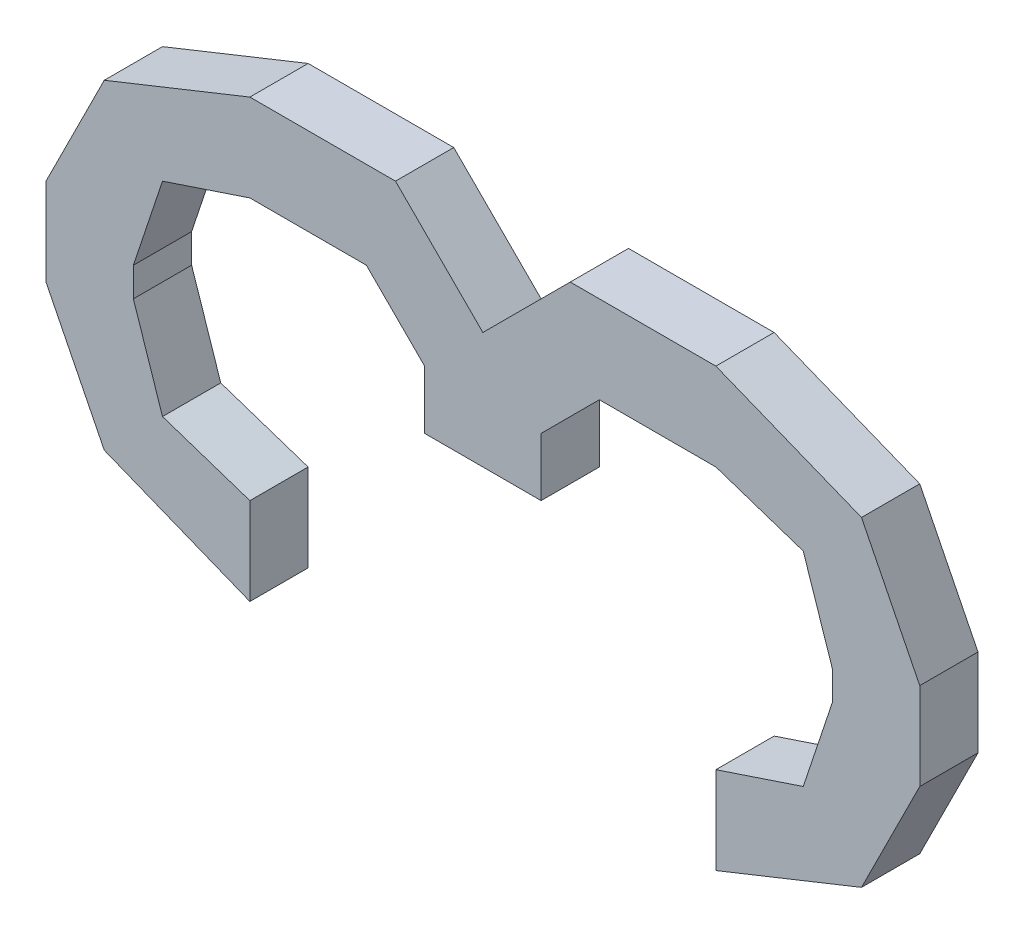
ISO-10303-21;
HEADER;
FILE_DESCRIPTION(('STEP AP214'),'2;1');
FILE_NAME('part.step','',(''),(''),'','','');
FILE_SCHEMA(('AUTOMOTIVE_DESIGN { 1 0 10303 214 1 1 1 1 }'));
ENDSEC;
DATA;
#1=APPLICATION_CONTEXT('core data for automotive mechanical design processes');
#2=APPLICATION_PROTOCOL_DEFINITION('international standard','automotive_design',2000,#1);
#3=PRODUCT_CONTEXT('',#1,'mechanical');
#4=PRODUCT('Part','Part','',(#3));
#5=PRODUCT_RELATED_PRODUCT_CATEGORY('part','',(#4));
#6=PRODUCT_DEFINITION_FORMATION('','',#4);
#7=PRODUCT_DEFINITION_CONTEXT('part definition',#1,'design');
#8=PRODUCT_DEFINITION('design','',#6,#7);
#9=PRODUCT_DEFINITION_SHAPE('','',#8);
#10=(LENGTH_UNIT() NAMED_UNIT(*) SI_UNIT(.MILLI.,.METRE.));
#11=(NAMED_UNIT(*) PLANE_ANGLE_UNIT() SI_UNIT($,.RADIAN.));
#12=(NAMED_UNIT(*) SI_UNIT($,.STERADIAN.) SOLID_ANGLE_UNIT());
#13=UNCERTAINTY_MEASURE_WITH_UNIT(LENGTH_MEASURE(1.E-05),#10,'distance_accuracy_value','');
#14=(GEOMETRIC_REPRESENTATION_CONTEXT(3) GLOBAL_UNCERTAINTY_ASSIGNED_CONTEXT((#13)) GLOBAL_UNIT_ASSIGNED_CONTEXT((#10,
#11,#12)) REPRESENTATION_CONTEXT('',''));
#15=CARTESIAN_POINT('',(0.,0.,0.));
#16=DIRECTION('',(0.,0.,1.));
#17=DIRECTION('',(1.,0.,0.));
#18=AXIS2_PLACEMENT_3D('',#15,#16,#17);
#19=CARTESIAN_POINT('',(-0.1016,-0.09524999999999,0.));
#20=DIRECTION('',(0.,0.,1.));
#21=DIRECTION('',(1.,0.,0.));
#22=AXIS2_PLACEMENT_3D('',#19,#20,#21);
#23=PLANE('',#22);
#24=DIRECTION('',(0.447213595499958,-0.894427190999916,0.));
#25=VECTOR('',#24,1.);
#26=CARTESIAN_POINT('',(-0.1651,-0.06985,0.));
#27=LINE('',#26,#25);
#28=CARTESIAN_POINT('',(-0.190500000000001,-0.0190499999999905,0.));
#29=VERTEX_POINT('',#28);
#30=CARTESIAN_POINT('',(-0.165099999999999,-0.0698499999999978,0.));
#31=VERTEX_POINT('',#30);
#32=EDGE_CURVE('E398',#29,#31,#27,.T.);
#33=ORIENTED_EDGE('',*,*,#32,.F.);
#34=DIRECTION('',(0.,1.,0.));
#35=VECTOR('',#34,1.);
#36=CARTESIAN_POINT('',(-0.1905,-0.01904999999999,0.));
#37=LINE('',#36,#35);
#38=CARTESIAN_POINT('',(-0.1905,0.01905000000002,0.));
#39=VERTEX_POINT('',#38);
#40=EDGE_CURVE('E393',#39,#29,#37,.F.);
#41=ORIENTED_EDGE('',*,*,#40,.F.);
#42=DIRECTION('',(-0.447213595499958,-0.894427190999916,0.));
#43=VECTOR('',#42,1.);
#44=CARTESIAN_POINT('',(-0.1905,0.01905000000002,0.));
#45=LINE('',#44,#43);
#46=CARTESIAN_POINT('',(-0.165100000000002,0.069850000000001,0.));
#47=VERTEX_POINT('',#46);
#48=EDGE_CURVE('E388',#47,#39,#45,.T.);
#49=ORIENTED_EDGE('',*,*,#48,.F.);
#50=DIRECTION('',(-0.928476690885259,-0.371390676354104,0.));
#51=VECTOR('',#50,1.);
#52=CARTESIAN_POINT('',(-0.1651,0.06985,0.));
#53=LINE('',#52,#51);
#54=CARTESIAN_POINT('',(-0.101599999999998,0.0952500000000157,0.));
#55=VERTEX_POINT('',#54);
#56=EDGE_CURVE('E383',#55,#47,#53,.T.);
#57=ORIENTED_EDGE('',*,*,#56,.F.);
#58=DIRECTION('',(1.,0.,0.));
#59=VECTOR('',#58,1.);
#60=CARTESIAN_POINT('',(-0.1016,0.09525000000002,0.));
#61=LINE('',#60,#59);
#62=CARTESIAN_POINT('',(-0.0381,0.09525000000002,0.));
#63=VERTEX_POINT('',#62);
#64=EDGE_CURVE('E378',#63,#55,#61,.F.);
#65=ORIENTED_EDGE('',*,*,#64,.F.);
#66=DIRECTION('',(-0.707106781186048,0.707106781187048,0.));
#67=VECTOR('',#66,1.);
#68=CARTESIAN_POINT('',(-0.0381,0.09525000000002,0.));
#69=LINE('',#68,#67);
#70=CARTESIAN_POINT('',(0.,0.0571500000000045,0.));
#71=VERTEX_POINT('',#70);
#72=EDGE_CURVE('E373',#71,#63,#69,.T.);
#73=ORIENTED_EDGE('',*,*,#72,.F.);
#74=DIRECTION('',(-0.707106781186048,-0.707106781187048,0.));
#75=VECTOR('',#74,1.);
#76=CARTESIAN_POINT('',(0.,0.05715000000001,0.));
#77=LINE('',#76,#75);
#78=CARTESIAN_POINT('',(0.0380999999999945,0.0952500000000255,0.));
#79=VERTEX_POINT('',#78);
#80=EDGE_CURVE('E368',#79,#71,#77,.T.);
#81=ORIENTED_EDGE('',*,*,#80,.F.);
#82=DIRECTION('',(1.,0.,0.));
#83=VECTOR('',#82,1.);
#84=CARTESIAN_POINT('',(0.0381,0.09525000000002,0.));
#85=LINE('',#84,#83);
#86=CARTESIAN_POINT('',(0.1016,0.09525000000002,0.));
#87=VERTEX_POINT('',#86);
#88=EDGE_CURVE('E363',#87,#79,#85,.F.);
#89=ORIENTED_EDGE('',*,*,#88,.F.);
#90=DIRECTION('',(-0.928476690885259,0.371390676354104,0.));
#91=VECTOR('',#90,1.);
#92=CARTESIAN_POINT('',(0.1016,0.09525000000002,0.));
#93=LINE('',#92,#91);
#94=CARTESIAN_POINT('',(0.165100000000002,0.0698500000000043,0.));
#95=VERTEX_POINT('',#94);
#96=EDGE_CURVE('E358',#95,#87,#93,.T.);
#97=ORIENTED_EDGE('',*,*,#96,.F.);
#98=DIRECTION('',(-0.447213595499958,0.894427190999916,0.));
#99=VECTOR('',#98,1.);
#100=CARTESIAN_POINT('',(0.1651,0.06985,0.));
#101=LINE('',#100,#99);
#102=CARTESIAN_POINT('',(0.190499999999998,0.019050000000019,0.));
#103=VERTEX_POINT('',#102);
#104=EDGE_CURVE('E353',#103,#95,#101,.T.);
#105=ORIENTED_EDGE('',*,*,#104,.F.);
#106=DIRECTION('',(0.,1.,0.));
#107=VECTOR('',#106,1.);
#108=CARTESIAN_POINT('',(0.1905,0.01905000000002,0.));
#109=LINE('',#108,#107);
#110=CARTESIAN_POINT('',(0.1905,-0.01904999999999,0.));
#111=VERTEX_POINT('',#110);
#112=EDGE_CURVE('E348',#111,#103,#109,.T.);
#113=ORIENTED_EDGE('',*,*,#112,.F.);
#114=DIRECTION('',(0.447213595499958,0.894427190999916,0.));
#115=VECTOR('',#114,1.);
#116=CARTESIAN_POINT('',(0.1905,-0.01904999999999,0.));
#117=LINE('',#116,#115);
#118=CARTESIAN_POINT('',(0.165099999999999,-0.0698499999999995,0.));
#119=VERTEX_POINT('',#118);
#120=EDGE_CURVE('E343',#119,#111,#117,.T.);
#121=ORIENTED_EDGE('',*,*,#120,.F.);
#122=DIRECTION('',(0.928476690885259,0.371390676354104,0.));
#123=VECTOR('',#122,1.);
#124=CARTESIAN_POINT('',(0.1651,-0.06985,0.));
#125=LINE('',#124,#123);
#126=CARTESIAN_POINT('',(0.101600000000001,-0.0952499999999921,0.));
#127=VERTEX_POINT('',#126);
#128=EDGE_CURVE('E338',#127,#119,#125,.T.);
#129=ORIENTED_EDGE('',*,*,#128,.F.);
#130=DIRECTION('',(0.,1.,0.));
#131=VECTOR('',#130,1.);
#132=CARTESIAN_POINT('',(0.1016,-0.09524999999999,0.));
#133=LINE('',#132,#131);
#134=CARTESIAN_POINT('',(0.1016,-0.05714999999998,0.));
#135=VERTEX_POINT('',#134);
#136=EDGE_CURVE('E333',#135,#127,#133,.F.);
#137=ORIENTED_EDGE('',*,*,#136,.F.);
#138=DIRECTION('',(-0.948683298050514,-0.316227766016838,0.));
#139=VECTOR('',#138,1.);
#140=CARTESIAN_POINT('',(0.1016,-0.05714999999998,0.));
#141=LINE('',#140,#139);
#142=CARTESIAN_POINT('',(0.1397,-0.04444999999998,0.));
#143=VERTEX_POINT('',#142);
#144=EDGE_CURVE('E328',#143,#135,#141,.T.);
#145=ORIENTED_EDGE('',*,*,#144,.F.);
#146=DIRECTION('',(-0.316227766016838,-0.948683298050514,0.));
#147=VECTOR('',#146,1.);
#148=CARTESIAN_POINT('',(0.1397,-0.04444999999998,0.));
#149=LINE('',#148,#147);
#150=CARTESIAN_POINT('',(0.152399999999999,-0.00634999999999755,0.));
#151=VERTEX_POINT('',#150);
#152=EDGE_CURVE('E323',#151,#143,#149,.T.);
#153=ORIENTED_EDGE('',*,*,#152,.F.);
#154=DIRECTION('',(0.,1.,0.));
#155=VECTOR('',#154,1.);
#156=CARTESIAN_POINT('',(0.1524,-0.006349999999998,0.));
#157=LINE('',#156,#155);
#158=CARTESIAN_POINT('',(0.1524,0.00634999999999803,0.));
#159=VERTEX_POINT('',#158);
#160=EDGE_CURVE('E318',#159,#151,#157,.F.);
#161=ORIENTED_EDGE('',*,*,#160,.F.);
#162=DIRECTION('',(0.316227766016838,-0.948683298050514,0.));
#163=VECTOR('',#162,1.);
#164=CARTESIAN_POINT('',(0.1524,0.006349999999998,0.));
#165=LINE('',#164,#163);
#166=CARTESIAN_POINT('',(0.139699999999999,0.0444500000000097,0.));
#167=VERTEX_POINT('',#166);
#168=EDGE_CURVE('E313',#167,#159,#165,.T.);
#169=ORIENTED_EDGE('',*,*,#168,.F.);
#170=DIRECTION('',(0.948683298050514,-0.316227766016838,0.));
#171=VECTOR('',#170,1.);
#172=CARTESIAN_POINT('',(0.1397,0.04445000000001,0.));
#173=LINE('',#172,#171);
#174=CARTESIAN_POINT('',(0.1016,0.05715000000001,0.));
#175=VERTEX_POINT('',#174);
#176=EDGE_CURVE('E308',#175,#167,#173,.T.);
#177=ORIENTED_EDGE('',*,*,#176,.F.);
#178=DIRECTION('',(1.,0.,0.));
#179=VECTOR('',#178,1.);
#180=CARTESIAN_POINT('',(0.1016,0.05715000000001,0.));
#181=LINE('',#180,#179);
#182=CARTESIAN_POINT('',(0.0508,0.05715000000001,0.));
#183=VERTEX_POINT('',#182);
#184=EDGE_CURVE('E303',#183,#175,#181,.T.);
#185=ORIENTED_EDGE('',*,*,#184,.F.);
#186=DIRECTION('',(0.707106781186548,0.707106781186548,0.));
#187=VECTOR('',#186,1.);
#188=CARTESIAN_POINT('',(0.0508,0.05715000000001,0.));
#189=LINE('',#188,#187);
#190=CARTESIAN_POINT('',(0.0254000000000013,0.0317500000000188,0.));
#191=VERTEX_POINT('',#190);
#192=EDGE_CURVE('E298',#191,#183,#189,.T.);
#193=ORIENTED_EDGE('',*,*,#192,.F.);
#194=DIRECTION('',(0.,1.,0.));
#195=VECTOR('',#194,1.);
#196=CARTESIAN_POINT('',(0.0254,0.03175000000002,0.));
#197=LINE('',#196,#195);
#198=CARTESIAN_POINT('',(0.0254,0.006349999999998,0.));
#199=VERTEX_POINT('',#198);
#200=EDGE_CURVE('E293',#199,#191,#197,.T.);
#201=ORIENTED_EDGE('',*,*,#200,.F.);
#202=DIRECTION('',(1.,0.,0.));
#203=VECTOR('',#202,1.);
#204=CARTESIAN_POINT('',(0.0254,0.006349999999998,0.));
#205=LINE('',#204,#203);
#206=CARTESIAN_POINT('',(-0.0254,0.006349999999998,0.));
#207=VERTEX_POINT('',#206);
#208=EDGE_CURVE('E288',#207,#199,#205,.T.);
#209=ORIENTED_EDGE('',*,*,#208,.F.);
#210=DIRECTION('',(0.,1.,0.));
#211=VECTOR('',#210,1.);
#212=CARTESIAN_POINT('',(-0.0254,0.006349999999998,0.));
#213=LINE('',#212,#211);
#214=CARTESIAN_POINT('',(-0.0254,0.03175000000002,0.));
#215=VERTEX_POINT('',#214);
#216=EDGE_CURVE('E283',#215,#207,#213,.F.);
#217=ORIENTED_EDGE('',*,*,#216,.F.);
#218=DIRECTION('',(0.707106781186548,-0.707106781186548,0.));
#219=VECTOR('',#218,1.);
#220=CARTESIAN_POINT('',(-0.0254,0.03175000000002,0.));
#221=LINE('',#220,#219);
#222=CARTESIAN_POINT('',(-0.0507999999999988,0.0571500000000113,0.));
#223=VERTEX_POINT('',#222);
#224=EDGE_CURVE('E278',#223,#215,#221,.T.);
#225=ORIENTED_EDGE('',*,*,#224,.F.);
#226=DIRECTION('',(1.,0.,0.));
#227=VECTOR('',#226,1.);
#228=CARTESIAN_POINT('',(-0.0508,0.05715000000001,0.));
#229=LINE('',#228,#227);
#230=CARTESIAN_POINT('',(-0.1016,0.05715000000001,0.));
#231=VERTEX_POINT('',#230);
#232=EDGE_CURVE('E273',#231,#223,#229,.T.);
#233=ORIENTED_EDGE('',*,*,#232,.F.);
#234=DIRECTION('',(0.948683298050514,0.316227766016838,0.));
#235=VECTOR('',#234,1.);
#236=CARTESIAN_POINT('',(-0.1016,0.05715000000001,0.));
#237=LINE('',#236,#235);
#238=CARTESIAN_POINT('',(-0.1397,0.04445000000001,0.));
#239=VERTEX_POINT('',#238);
#240=EDGE_CURVE('E268',#239,#231,#237,.T.);
#241=ORIENTED_EDGE('',*,*,#240,.F.);
#242=DIRECTION('',(0.316227766016838,0.948683298050514,0.));
#243=VECTOR('',#242,1.);
#244=CARTESIAN_POINT('',(-0.1397,0.04445000000001,0.));
#245=LINE('',#244,#243);
#246=CARTESIAN_POINT('',(-0.152400000000001,0.00634999999999833,0.));
#247=VERTEX_POINT('',#246);
#248=EDGE_CURVE('E263',#247,#239,#245,.T.);
#249=ORIENTED_EDGE('',*,*,#248,.F.);
#250=DIRECTION('',(0.,1.,0.));
#251=VECTOR('',#250,1.);
#252=CARTESIAN_POINT('',(-0.1524,0.006349999999998,0.));
#253=LINE('',#252,#251);
#254=CARTESIAN_POINT('',(-0.1524,-0.00634999999999801,0.));
#255=VERTEX_POINT('',#254);
#256=EDGE_CURVE('E258',#255,#247,#253,.T.);
#257=ORIENTED_EDGE('',*,*,#256,.F.);
#258=DIRECTION('',(-0.316227766016838,0.948683298050514,0.));
#259=VECTOR('',#258,1.);
#260=CARTESIAN_POINT('',(-0.1524,-0.006349999999998,0.));
#261=LINE('',#260,#259);
#262=CARTESIAN_POINT('',(-0.139700000000001,-0.0444499999999805,0.));
#263=VERTEX_POINT('',#262);
#264=EDGE_CURVE('E244',#263,#255,#261,.T.);
#265=ORIENTED_EDGE('',*,*,#264,.F.);
#266=DIRECTION('',(-0.948683298050514,0.316227766016838,0.));
#267=VECTOR('',#266,1.);
#268=CARTESIAN_POINT('',(-0.1397,-0.04444999999998,0.));
#269=LINE('',#268,#267);
#270=CARTESIAN_POINT('',(-0.1016,-0.05714999999998,0.));
#271=VERTEX_POINT('',#270);
#272=EDGE_CURVE('E229',#271,#263,#269,.T.);
#273=ORIENTED_EDGE('',*,*,#272,.F.);
#274=DIRECTION('',(0.,1.,0.));
#275=VECTOR('',#274,1.);
#276=CARTESIAN_POINT('',(-0.1016,-0.05714999999998,0.));
#277=LINE('',#276,#275);
#278=CARTESIAN_POINT('',(-0.1016,-0.09524999999999,0.));
#279=VERTEX_POINT('',#278);
#280=EDGE_CURVE('E20',#279,#271,#277,.T.);
#281=ORIENTED_EDGE('',*,*,#280,.F.);
#282=DIRECTION('',(0.928476690885259,-0.371390676354104,0.));
#283=VECTOR('',#282,1.);
#284=CARTESIAN_POINT('',(-0.1016,-0.09524999999999,0.));
#285=LINE('',#284,#283);
#286=EDGE_CURVE('E402',#31,#279,#285,.T.);
#287=ORIENTED_EDGE('',*,*,#286,.F.);
#288=EDGE_LOOP('',(#33,#41,#49,#57,#65,#73,#81,#89,#97,#105,#113,#121,#129,#137,#145,#153,#161,
#169,#177,#185,#193,#201,#209,#217,#225,#233,#241,#249,#257,#265,#273,#281,#287));
#289=FACE_BOUND('',#288,.T.);
#290=ADVANCED_FACE('F17',(#289),#23,.F.);
#291=CARTESIAN_POINT('',(-0.1016,-0.05714999999998,0.));
#292=DIRECTION('',(1.,0.,0.));
#293=DIRECTION('',(0.,0.,-1.));
#294=AXIS2_PLACEMENT_3D('',#291,#292,#293);
#295=PLANE('',#294);
#296=DIRECTION('',(0.,0.,1.));
#297=VECTOR('',#296,1.);
#298=CARTESIAN_POINT('',(-0.1016,-0.09524999999999,0.));
#299=LINE('',#298,#297);
#300=CARTESIAN_POINT('',(-0.1016,-0.09524999999999,0.0254));
#301=VERTEX_POINT('',#300);
#302=EDGE_CURVE('E238',#279,#301,#299,.T.);
#303=ORIENTED_EDGE('',*,*,#302,.F.);
#304=ORIENTED_EDGE('',*,*,#280,.T.);
#305=DIRECTION('',(0.,0.,1.));
#306=VECTOR('',#305,1.);
#307=CARTESIAN_POINT('',(-0.1016,-0.05714999999998,0.));
#308=LINE('',#307,#306);
#309=CARTESIAN_POINT('',(-0.1016,-0.05714999999998,0.0254));
#310=VERTEX_POINT('',#309);
#311=EDGE_CURVE('E235',#310,#271,#308,.F.);
#312=ORIENTED_EDGE('',*,*,#311,.F.);
#313=DIRECTION('',(0.,1.,0.));
#314=VECTOR('',#313,1.);
#315=CARTESIAN_POINT('',(-0.1016,-0.09524999999999,0.0254));
#316=LINE('',#315,#314);
#317=EDGE_CURVE('E404',#301,#310,#316,.T.);
#318=ORIENTED_EDGE('',*,*,#317,.F.);
#319=EDGE_LOOP('',(#303,#304,#312,#318));
#320=FACE_BOUND('',#319,.T.);
#321=ADVANCED_FACE('F234',(#320),#295,.T.);
#322=CARTESIAN_POINT('',(-0.1397,-0.04444999999998,0.));
#323=DIRECTION('',(0.316227766016838,0.948683298050514,0.));
#324=DIRECTION('',(-0.948683298050514,0.316227766016838,0.));
#325=AXIS2_PLACEMENT_3D('',#322,#323,#324);
#326=PLANE('',#325);
#327=ORIENTED_EDGE('',*,*,#311,.T.);
#328=ORIENTED_EDGE('',*,*,#272,.T.);
#329=DIRECTION('',(0.,0.,1.));
#330=VECTOR('',#329,1.);
#331=CARTESIAN_POINT('',(-0.139700000000005,-0.0444499999999818,0.));
#332=LINE('',#331,#330);
#333=CARTESIAN_POINT('',(-0.139700000000001,-0.0444499999999805,0.0254));
#334=VERTEX_POINT('',#333);
#335=EDGE_CURVE('E246',#334,#263,#332,.F.);
#336=ORIENTED_EDGE('',*,*,#335,.F.);
#337=DIRECTION('',(-0.948683298050514,0.316227766016838,0.));
#338=VECTOR('',#337,1.);
#339=CARTESIAN_POINT('',(-0.1016,-0.05714999999998,0.0254));
#340=LINE('',#339,#338);
#341=EDGE_CURVE('E250',#310,#334,#340,.T.);
#342=ORIENTED_EDGE('',*,*,#341,.F.);
#343=EDGE_LOOP('',(#327,#328,#336,#342));
#344=FACE_BOUND('',#343,.T.);
#345=ADVANCED_FACE('F248',(#344),#326,.T.);
#346=CARTESIAN_POINT('',(-0.1524,-0.006349999999998,0.));
#347=DIRECTION('',(0.948683298050514,0.316227766016838,0.));
#348=DIRECTION('',(-0.316227766016838,0.948683298050514,0.));
#349=AXIS2_PLACEMENT_3D('',#346,#347,#348);
#350=PLANE('',#349);
#351=ORIENTED_EDGE('',*,*,#335,.T.);
#352=ORIENTED_EDGE('',*,*,#264,.T.);
#353=DIRECTION('',(0.,0.,-1.));
#354=VECTOR('',#353,1.);
#355=CARTESIAN_POINT('',(-0.1524,-0.006349999999998,0.));
#356=LINE('',#355,#354);
#357=CARTESIAN_POINT('',(-0.1524,-0.00634999999999801,0.0254));
#358=VERTEX_POINT('',#357);
#359=EDGE_CURVE('E255',#358,#255,#356,.T.);
#360=ORIENTED_EDGE('',*,*,#359,.F.);
#361=DIRECTION('',(-0.316227766016973,0.948683298050469,0.));
#362=VECTOR('',#361,1.);
#363=CARTESIAN_POINT('',(-0.1397,-0.04444999999998,0.0254));
#364=LINE('',#363,#362);
#365=EDGE_CURVE('E407',#334,#358,#364,.T.);
#366=ORIENTED_EDGE('',*,*,#365,.F.);
#367=EDGE_LOOP('',(#351,#352,#360,#366));
#368=FACE_BOUND('',#367,.T.);
#369=ADVANCED_FACE('F624',(#368),#350,.T.);
#370=CARTESIAN_POINT('',(-0.1524,0.006349999999998,0.));
#371=DIRECTION('',(1.,0.,0.));
#372=DIRECTION('',(0.,0.,-1.));
#373=AXIS2_PLACEMENT_3D('',#370,#371,#372);
#374=PLANE('',#373);
#375=ORIENTED_EDGE('',*,*,#359,.T.);
#376=ORIENTED_EDGE('',*,*,#256,.T.);
#377=DIRECTION('',(0.,0.,1.));
#378=VECTOR('',#377,1.);
#379=CARTESIAN_POINT('',(-0.152400000000004,0.00634999999999918,0.));
#380=LINE('',#379,#378);
#381=CARTESIAN_POINT('',(-0.152400000000001,0.00634999999999833,0.0254));
#382=VERTEX_POINT('',#381);
#383=EDGE_CURVE('E260',#382,#247,#380,.F.);
#384=ORIENTED_EDGE('',*,*,#383,.F.);
#385=DIRECTION('',(0.,1.,0.));
#386=VECTOR('',#385,1.);
#387=CARTESIAN_POINT('',(-0.1524,-0.09524999999999,0.0254));
#388=LINE('',#387,#386);
#389=EDGE_CURVE('E410',#358,#382,#388,.T.);
#390=ORIENTED_EDGE('',*,*,#389,.F.);
#391=EDGE_LOOP('',(#375,#376,#384,#390));
#392=FACE_BOUND('',#391,.T.);
#393=ADVANCED_FACE('F620',(#392),#374,.T.);
#394=CARTESIAN_POINT('',(-0.1397,0.04445000000001,0.));
#395=DIRECTION('',(0.948683298050514,-0.316227766016838,0.));
#396=DIRECTION('',(0.316227766016838,0.948683298050514,0.));
#397=AXIS2_PLACEMENT_3D('',#394,#395,#396);
#398=PLANE('',#397);
#399=ORIENTED_EDGE('',*,*,#383,.T.);
#400=ORIENTED_EDGE('',*,*,#248,.T.);
#401=DIRECTION('',(0.,0.,1.));
#402=VECTOR('',#401,1.);
#403=CARTESIAN_POINT('',(-0.1397,0.04445000000001,0.));
#404=LINE('',#403,#402);
#405=CARTESIAN_POINT('',(-0.1397,0.04445000000001,0.0254));
#406=VERTEX_POINT('',#405);
#407=EDGE_CURVE('E265',#406,#239,#404,.F.);
#408=ORIENTED_EDGE('',*,*,#407,.F.);
#409=DIRECTION('',(0.316227766016749,0.948683298050543,0.));
#410=VECTOR('',#409,1.);
#411=CARTESIAN_POINT('',(-0.1524,0.006349999999998,0.0254));
#412=LINE('',#411,#410);
#413=EDGE_CURVE('E413',#382,#406,#412,.T.);
#414=ORIENTED_EDGE('',*,*,#413,.F.);
#415=EDGE_LOOP('',(#399,#400,#408,#414));
#416=FACE_BOUND('',#415,.T.);
#417=ADVANCED_FACE('F616',(#416),#398,.T.);
#418=CARTESIAN_POINT('',(-0.1016,0.05715000000001,0.));
#419=DIRECTION('',(0.316227766016838,-0.948683298050514,0.));
#420=DIRECTION('',(0.948683298050514,0.316227766016838,0.));
#421=AXIS2_PLACEMENT_3D('',#418,#419,#420);
#422=PLANE('',#421);
#423=ORIENTED_EDGE('',*,*,#407,.T.);
#424=ORIENTED_EDGE('',*,*,#240,.T.);
#425=DIRECTION('',(0.,0.,-1.));
#426=VECTOR('',#425,1.);
#427=CARTESIAN_POINT('',(-0.1016,0.05715000000001,0.));
#428=LINE('',#427,#426);
#429=CARTESIAN_POINT('',(-0.1016,0.05715000000001,0.0254));
#430=VERTEX_POINT('',#429);
#431=EDGE_CURVE('E270',#430,#231,#428,.T.);
#432=ORIENTED_EDGE('',*,*,#431,.F.);
#433=DIRECTION('',(0.948683298050514,0.316227766016838,0.));
#434=VECTOR('',#433,1.);
#435=CARTESIAN_POINT('',(-0.1397,0.04445000000001,0.0254));
#436=LINE('',#435,#434);
#437=EDGE_CURVE('E416',#406,#430,#436,.T.);
#438=ORIENTED_EDGE('',*,*,#437,.F.);
#439=EDGE_LOOP('',(#423,#424,#432,#438));
#440=FACE_BOUND('',#439,.T.);
#441=ADVANCED_FACE('F612',(#440),#422,.T.);
#442=CARTESIAN_POINT('',(-0.0508,0.05715000000001,0.));
#443=DIRECTION('',(0.,-1.,0.));
#444=DIRECTION('',(0.,0.,-1.));
#445=AXIS2_PLACEMENT_3D('',#442,#443,#444);
#446=PLANE('',#445);
#447=ORIENTED_EDGE('',*,*,#431,.T.);
#448=ORIENTED_EDGE('',*,*,#232,.T.);
#449=DIRECTION('',(0.,0.,1.));
#450=VECTOR('',#449,1.);
#451=CARTESIAN_POINT('',(-0.050799999999995,0.057150000000015,0.));
#452=LINE('',#451,#450);
#453=CARTESIAN_POINT('',(-0.0507999999999988,0.0571500000000112,0.0254));
#454=VERTEX_POINT('',#453);
#455=EDGE_CURVE('E275',#454,#223,#452,.F.);
#456=ORIENTED_EDGE('',*,*,#455,.F.);
#457=DIRECTION('',(1.,0.,0.));
#458=VECTOR('',#457,1.);
#459=CARTESIAN_POINT('',(-0.1016,0.05715000000001,0.0254));
#460=LINE('',#459,#458);
#461=EDGE_CURVE('E419',#430,#454,#460,.T.);
#462=ORIENTED_EDGE('',*,*,#461,.F.);
#463=EDGE_LOOP('',(#447,#448,#456,#462));
#464=FACE_BOUND('',#463,.T.);
#465=ADVANCED_FACE('F608',(#464),#446,.T.);
#466=CARTESIAN_POINT('',(-0.0254,0.03175000000002,0.));
#467=DIRECTION('',(-0.707106781186548,-0.707106781186548,0.));
#468=DIRECTION('',(0.707106781186548,-0.707106781186548,0.));
#469=AXIS2_PLACEMENT_3D('',#466,#467,#468);
#470=PLANE('',#469);
#471=ORIENTED_EDGE('',*,*,#455,.T.);
#472=ORIENTED_EDGE('',*,*,#224,.T.);
#473=DIRECTION('',(0.,0.,1.));
#474=VECTOR('',#473,1.);
#475=CARTESIAN_POINT('',(-0.0254,0.03175000000002,0.));
#476=LINE('',#475,#474);
#477=CARTESIAN_POINT('',(-0.0254,0.03175000000002,0.0254));
#478=VERTEX_POINT('',#477);
#479=EDGE_CURVE('E280',#478,#215,#476,.F.);
#480=ORIENTED_EDGE('',*,*,#479,.F.);
#481=DIRECTION('',(0.707106781186687,-0.707106781186408,0.));
#482=VECTOR('',#481,1.);
#483=CARTESIAN_POINT('',(-0.0508,0.05715000000001,0.0254));
#484=LINE('',#483,#482);
#485=EDGE_CURVE('E422',#454,#478,#484,.T.);
#486=ORIENTED_EDGE('',*,*,#485,.F.);
#487=EDGE_LOOP('',(#471,#472,#480,#486));
#488=FACE_BOUND('',#487,.T.);
#489=ADVANCED_FACE('F604',(#488),#470,.T.);
#490=CARTESIAN_POINT('',(-0.0254,0.006349999999998,0.));
#491=DIRECTION('',(-1.,0.,0.));
#492=DIRECTION('',(0.,0.,1.));
#493=AXIS2_PLACEMENT_3D('',#490,#491,#492);
#494=PLANE('',#493);
#495=ORIENTED_EDGE('',*,*,#479,.T.);
#496=ORIENTED_EDGE('',*,*,#216,.T.);
#497=DIRECTION('',(0.,0.,-1.));
#498=VECTOR('',#497,1.);
#499=CARTESIAN_POINT('',(-0.0254,0.006349999999998,0.));
#500=LINE('',#499,#498);
#501=CARTESIAN_POINT('',(-0.0254,0.006349999999998,0.0254));
#502=VERTEX_POINT('',#501);
#503=EDGE_CURVE('E285',#502,#207,#500,.T.);
#504=ORIENTED_EDGE('',*,*,#503,.F.);
#505=DIRECTION('',(0.,1.,0.));
#506=VECTOR('',#505,1.);
#507=CARTESIAN_POINT('',(-0.0254,-0.09524999999999,0.0254));
#508=LINE('',#507,#506);
#509=EDGE_CURVE('E425',#478,#502,#508,.F.);
#510=ORIENTED_EDGE('',*,*,#509,.F.);
#511=EDGE_LOOP('',(#495,#496,#504,#510));
#512=FACE_BOUND('',#511,.T.);
#513=ADVANCED_FACE('F600',(#512),#494,.T.);
#514=CARTESIAN_POINT('',(0.0254,0.006349999999998,0.));
#515=DIRECTION('',(0.,-1.,0.));
#516=DIRECTION('',(0.,0.,-1.));
#517=AXIS2_PLACEMENT_3D('',#514,#515,#516);
#518=PLANE('',#517);
#519=ORIENTED_EDGE('',*,*,#503,.T.);
#520=ORIENTED_EDGE('',*,*,#208,.T.);
#521=DIRECTION('',(0.,0.,-1.));
#522=VECTOR('',#521,1.);
#523=CARTESIAN_POINT('',(0.0254,0.006349999999998,0.));
#524=LINE('',#523,#522);
#525=CARTESIAN_POINT('',(0.0254,0.006349999999998,0.0254));
#526=VERTEX_POINT('',#525);
#527=EDGE_CURVE('E290',#526,#199,#524,.T.);
#528=ORIENTED_EDGE('',*,*,#527,.F.);
#529=DIRECTION('',(1.,0.,0.));
#530=VECTOR('',#529,1.);
#531=CARTESIAN_POINT('',(-0.1016,0.006349999999998,0.0254));
#532=LINE('',#531,#530);
#533=EDGE_CURVE('E428',#502,#526,#532,.T.);
#534=ORIENTED_EDGE('',*,*,#533,.F.);
#535=EDGE_LOOP('',(#519,#520,#528,#534));
#536=FACE_BOUND('',#535,.T.);
#537=ADVANCED_FACE('F596',(#536),#518,.T.);
#538=CARTESIAN_POINT('',(0.0254,0.03175000000002,0.));
#539=DIRECTION('',(1.,0.,0.));
#540=DIRECTION('',(0.,0.,-1.));
#541=AXIS2_PLACEMENT_3D('',#538,#539,#540);
#542=PLANE('',#541);
#543=ORIENTED_EDGE('',*,*,#527,.T.);
#544=ORIENTED_EDGE('',*,*,#200,.T.);
#545=DIRECTION('',(0.,0.,1.));
#546=VECTOR('',#545,1.);
#547=CARTESIAN_POINT('',(0.025400000000005,0.031750000000015,0.));
#548=LINE('',#547,#546);
#549=CARTESIAN_POINT('',(0.0254000000000013,0.0317500000000188,0.0254));
#550=VERTEX_POINT('',#549);
#551=EDGE_CURVE('E295',#550,#191,#548,.F.);
#552=ORIENTED_EDGE('',*,*,#551,.F.);
#553=DIRECTION('',(0.,1.,0.));
#554=VECTOR('',#553,1.);
#555=CARTESIAN_POINT('',(0.0254,-0.09524999999999,0.0254));
#556=LINE('',#555,#554);
#557=EDGE_CURVE('E431',#526,#550,#556,.T.);
#558=ORIENTED_EDGE('',*,*,#557,.F.);
#559=EDGE_LOOP('',(#543,#544,#552,#558));
#560=FACE_BOUND('',#559,.T.);
#561=ADVANCED_FACE('F592',(#560),#542,.T.);
#562=CARTESIAN_POINT('',(0.0508,0.05715000000001,0.));
#563=DIRECTION('',(0.707106781186548,-0.707106781186548,0.));
#564=DIRECTION('',(0.707106781186548,0.707106781186548,0.));
#565=AXIS2_PLACEMENT_3D('',#562,#563,#564);
#566=PLANE('',#565);
#567=ORIENTED_EDGE('',*,*,#551,.T.);
#568=ORIENTED_EDGE('',*,*,#192,.T.);
#569=DIRECTION('',(0.,0.,-1.));
#570=VECTOR('',#569,1.);
#571=CARTESIAN_POINT('',(0.0508,0.05715000000001,0.));
#572=LINE('',#571,#570);
#573=CARTESIAN_POINT('',(0.0508,0.05715000000001,0.0254));
#574=VERTEX_POINT('',#573);
#575=EDGE_CURVE('E300',#574,#183,#572,.T.);
#576=ORIENTED_EDGE('',*,*,#575,.F.);
#577=DIRECTION('',(0.707106781186687,0.707106781186408,0.));
#578=VECTOR('',#577,1.);
#579=CARTESIAN_POINT('',(0.0254,0.03175000000002,0.0254));
#580=LINE('',#579,#578);
#581=EDGE_CURVE('E434',#550,#574,#580,.T.);
#582=ORIENTED_EDGE('',*,*,#581,.F.);
#583=EDGE_LOOP('',(#567,#568,#576,#582));
#584=FACE_BOUND('',#583,.T.);
#585=ADVANCED_FACE('F588',(#584),#566,.T.);
#586=CARTESIAN_POINT('',(0.1016,0.05715000000001,0.));
#587=DIRECTION('',(0.,-1.,0.));
#588=DIRECTION('',(0.,0.,-1.));
#589=AXIS2_PLACEMENT_3D('',#586,#587,#588);
#590=PLANE('',#589);
#591=ORIENTED_EDGE('',*,*,#575,.T.);
#592=ORIENTED_EDGE('',*,*,#184,.T.);
#593=DIRECTION('',(0.,0.,1.));
#594=VECTOR('',#593,1.);
#595=CARTESIAN_POINT('',(0.1016,0.05715000000001,0.));
#596=LINE('',#595,#594);
#597=CARTESIAN_POINT('',(0.1016,0.05715000000001,0.0254));
#598=VERTEX_POINT('',#597);
#599=EDGE_CURVE('E305',#598,#175,#596,.F.);
#600=ORIENTED_EDGE('',*,*,#599,.F.);
#601=DIRECTION('',(1.,0.,0.));
#602=VECTOR('',#601,1.);
#603=CARTESIAN_POINT('',(-0.1016,0.05715000000001,0.0254));
#604=LINE('',#603,#602);
#605=EDGE_CURVE('E437',#574,#598,#604,.T.);
#606=ORIENTED_EDGE('',*,*,#605,.F.);
#607=EDGE_LOOP('',(#591,#592,#600,#606));
#608=FACE_BOUND('',#607,.T.);
#609=ADVANCED_FACE('F584',(#608),#590,.T.);
#610=CARTESIAN_POINT('',(0.1397,0.04445000000001,0.));
#611=DIRECTION('',(-0.316227766016838,-0.948683298050514,0.));
#612=DIRECTION('',(0.948683298050514,-0.316227766016838,0.));
#613=AXIS2_PLACEMENT_3D('',#610,#611,#612);
#614=PLANE('',#613);
#615=ORIENTED_EDGE('',*,*,#599,.T.);
#616=ORIENTED_EDGE('',*,*,#176,.T.);
#617=DIRECTION('',(0.,0.,1.));
#618=VECTOR('',#617,1.);
#619=CARTESIAN_POINT('',(0.139699999999996,0.0444500000000088,0.));
#620=LINE('',#619,#618);
#621=CARTESIAN_POINT('',(0.139699999999999,0.0444500000000097,0.0254));
#622=VERTEX_POINT('',#621);
#623=EDGE_CURVE('E310',#622,#167,#620,.F.);
#624=ORIENTED_EDGE('',*,*,#623,.F.);
#625=DIRECTION('',(0.948683298050514,-0.316227766016838,0.));
#626=VECTOR('',#625,1.);
#627=CARTESIAN_POINT('',(0.1016,0.05715000000001,0.0254));
#628=LINE('',#627,#626);
#629=EDGE_CURVE('E440',#598,#622,#628,.T.);
#630=ORIENTED_EDGE('',*,*,#629,.F.);
#631=EDGE_LOOP('',(#615,#616,#624,#630));
#632=FACE_BOUND('',#631,.T.);
#633=ADVANCED_FACE('F580',(#632),#614,.T.);
#634=CARTESIAN_POINT('',(0.1524,0.006349999999998,0.));
#635=DIRECTION('',(-0.948683298050514,-0.316227766016838,0.));
#636=DIRECTION('',(0.316227766016838,-0.948683298050514,0.));
#637=AXIS2_PLACEMENT_3D('',#634,#635,#636);
#638=PLANE('',#637);
#639=ORIENTED_EDGE('',*,*,#623,.T.);
#640=ORIENTED_EDGE('',*,*,#168,.T.);
#641=DIRECTION('',(0.,0.,1.));
#642=VECTOR('',#641,1.);
#643=CARTESIAN_POINT('',(0.1524,0.006349999999998,0.));
#644=LINE('',#643,#642);
#645=CARTESIAN_POINT('',(0.1524,0.00634999999999803,0.0254));
#646=VERTEX_POINT('',#645);
#647=EDGE_CURVE('E315',#646,#159,#644,.F.);
#648=ORIENTED_EDGE('',*,*,#647,.F.);
#649=DIRECTION('',(0.316227766016748,-0.948683298050544,0.));
#650=VECTOR('',#649,1.);
#651=CARTESIAN_POINT('',(0.1397,0.04445000000001,0.0254));
#652=LINE('',#651,#650);
#653=EDGE_CURVE('E443',#622,#646,#652,.T.);
#654=ORIENTED_EDGE('',*,*,#653,.F.);
#655=EDGE_LOOP('',(#639,#640,#648,#654));
#656=FACE_BOUND('',#655,.T.);
#657=ADVANCED_FACE('F576',(#656),#638,.T.);
#658=CARTESIAN_POINT('',(0.1524,-0.006349999999998,0.));
#659=DIRECTION('',(-1.,0.,0.));
#660=DIRECTION('',(0.,0.,1.));
#661=AXIS2_PLACEMENT_3D('',#658,#659,#660);
#662=PLANE('',#661);
#663=ORIENTED_EDGE('',*,*,#647,.T.);
#664=ORIENTED_EDGE('',*,*,#160,.T.);
#665=DIRECTION('',(0.,0.,1.));
#666=VECTOR('',#665,1.);
#667=CARTESIAN_POINT('',(0.152399999999995,-0.00634999999999618,0.));
#668=LINE('',#667,#666);
#669=CARTESIAN_POINT('',(0.152399999999999,-0.00634999999999756,0.0254));
#670=VERTEX_POINT('',#669);
#671=EDGE_CURVE('E320',#670,#151,#668,.F.);
#672=ORIENTED_EDGE('',*,*,#671,.F.);
#673=DIRECTION('',(0.,1.,0.));
#674=VECTOR('',#673,1.);
#675=CARTESIAN_POINT('',(0.1524,-0.09524999999999,0.0254));
#676=LINE('',#675,#674);
#677=EDGE_CURVE('E446',#646,#670,#676,.F.);
#678=ORIENTED_EDGE('',*,*,#677,.F.);
#679=EDGE_LOOP('',(#663,#664,#672,#678));
#680=FACE_BOUND('',#679,.T.);
#681=ADVANCED_FACE('F572',(#680),#662,.T.);
#682=CARTESIAN_POINT('',(0.1397,-0.04444999999998,0.));
#683=DIRECTION('',(-0.948683298050514,0.316227766016838,0.));
#684=DIRECTION('',(-0.316227766016838,-0.948683298050514,0.));
#685=AXIS2_PLACEMENT_3D('',#682,#683,#684);
#686=PLANE('',#685);
#687=ORIENTED_EDGE('',*,*,#671,.T.);
#688=ORIENTED_EDGE('',*,*,#152,.T.);
#689=DIRECTION('',(0.,0.,1.));
#690=VECTOR('',#689,1.);
#691=CARTESIAN_POINT('',(0.1397,-0.04444999999998,0.));
#692=LINE('',#691,#690);
#693=CARTESIAN_POINT('',(0.1397,-0.04444999999998,0.0254));
#694=VERTEX_POINT('',#693);
#695=EDGE_CURVE('E325',#694,#143,#692,.F.);
#696=ORIENTED_EDGE('',*,*,#695,.F.);
#697=DIRECTION('',(-0.316227766016973,-0.948683298050469,0.));
#698=VECTOR('',#697,1.);
#699=CARTESIAN_POINT('',(0.1524,-0.006349999999998,0.0254));
#700=LINE('',#699,#698);
#701=EDGE_CURVE('E449',#670,#694,#700,.T.);
#702=ORIENTED_EDGE('',*,*,#701,.F.);
#703=EDGE_LOOP('',(#687,#688,#696,#702));
#704=FACE_BOUND('',#703,.T.);
#705=ADVANCED_FACE('F568',(#704),#686,.T.);
#706=CARTESIAN_POINT('',(0.1016,-0.05714999999998,0.));
#707=DIRECTION('',(-0.316227766016838,0.948683298050514,0.));
#708=DIRECTION('',(-0.948683298050514,-0.316227766016838,0.));
#709=AXIS2_PLACEMENT_3D('',#706,#707,#708);
#710=PLANE('',#709);
#711=ORIENTED_EDGE('',*,*,#695,.T.);
#712=ORIENTED_EDGE('',*,*,#144,.T.);
#713=DIRECTION('',(0.,0.,1.));
#714=VECTOR('',#713,1.);
#715=CARTESIAN_POINT('',(0.1016,-0.05714999999998,0.));
#716=LINE('',#715,#714);
#717=CARTESIAN_POINT('',(0.1016,-0.05714999999998,0.0254));
#718=VERTEX_POINT('',#717);
#719=EDGE_CURVE('E330',#718,#135,#716,.F.);
#720=ORIENTED_EDGE('',*,*,#719,.F.);
#721=DIRECTION('',(-0.948683298050514,-0.316227766016838,0.));
#722=VECTOR('',#721,1.);
#723=CARTESIAN_POINT('',(0.1397,-0.04444999999998,0.0254));
#724=LINE('',#723,#722);
#725=EDGE_CURVE('E452',#694,#718,#724,.T.);
#726=ORIENTED_EDGE('',*,*,#725,.F.);
#727=EDGE_LOOP('',(#711,#712,#720,#726));
#728=FACE_BOUND('',#727,.T.);
#729=ADVANCED_FACE('F564',(#728),#710,.T.);
#730=CARTESIAN_POINT('',(0.1016,-0.09524999999999,0.));
#731=DIRECTION('',(-1.,0.,0.));
#732=DIRECTION('',(0.,0.,1.));
#733=AXIS2_PLACEMENT_3D('',#730,#731,#732);
#734=PLANE('',#733);
#735=ORIENTED_EDGE('',*,*,#719,.T.);
#736=ORIENTED_EDGE('',*,*,#136,.T.);
#737=DIRECTION('',(0.,0.,1.));
#738=VECTOR('',#737,1.);
#739=CARTESIAN_POINT('',(0.101600000000003,-0.0952499999999986,0.));
#740=LINE('',#739,#738);
#741=CARTESIAN_POINT('',(0.101600000000001,-0.0952499999999921,0.0254));
#742=VERTEX_POINT('',#741);
#743=EDGE_CURVE('E335',#742,#127,#740,.F.);
#744=ORIENTED_EDGE('',*,*,#743,.F.);
#745=DIRECTION('',(0.,1.,0.));
#746=VECTOR('',#745,1.);
#747=CARTESIAN_POINT('',(0.1016,-0.09524999999999,0.0254));
#748=LINE('',#747,#746);
#749=EDGE_CURVE('E455',#718,#742,#748,.F.);
#750=ORIENTED_EDGE('',*,*,#749,.F.);
#751=EDGE_LOOP('',(#735,#736,#744,#750));
#752=FACE_BOUND('',#751,.T.);
#753=ADVANCED_FACE('F560',(#752),#734,.T.);
#754=CARTESIAN_POINT('',(0.1651,-0.06985,0.));
#755=DIRECTION('',(0.371390676354104,-0.928476690885259,0.));
#756=DIRECTION('',(0.928476690885259,0.371390676354104,0.));
#757=AXIS2_PLACEMENT_3D('',#754,#755,#756);
#758=PLANE('',#757);
#759=ORIENTED_EDGE('',*,*,#743,.T.);
#760=ORIENTED_EDGE('',*,*,#128,.T.);
#761=DIRECTION('',(0.,0.,1.));
#762=VECTOR('',#761,1.);
#763=CARTESIAN_POINT('',(0.165099999999996,-0.069849999999998,0.));
#764=LINE('',#763,#762);
#765=CARTESIAN_POINT('',(0.165099999999999,-0.0698499999999995,0.0254));
#766=VERTEX_POINT('',#765);
#767=EDGE_CURVE('E340',#766,#119,#764,.F.);
#768=ORIENTED_EDGE('',*,*,#767,.F.);
#769=DIRECTION('',(0.92847669088531,0.371390676353978,0.));
#770=VECTOR('',#769,1.);
#771=CARTESIAN_POINT('',(0.1016,-0.09524999999999,0.0254));
#772=LINE('',#771,#770);
#773=EDGE_CURVE('E458',#742,#766,#772,.T.);
#774=ORIENTED_EDGE('',*,*,#773,.F.);
#775=EDGE_LOOP('',(#759,#760,#768,#774));
#776=FACE_BOUND('',#775,.T.);
#777=ADVANCED_FACE('F556',(#776),#758,.T.);
#778=CARTESIAN_POINT('',(0.1905,-0.01904999999999,0.));
#779=DIRECTION('',(0.894427190999916,-0.447213595499958,0.));
#780=DIRECTION('',(0.447213595499958,0.894427190999916,0.));
#781=AXIS2_PLACEMENT_3D('',#778,#779,#780);
#782=PLANE('',#781);
#783=ORIENTED_EDGE('',*,*,#767,.T.);
#784=ORIENTED_EDGE('',*,*,#120,.T.);
#785=DIRECTION('',(0.,0.,-1.));
#786=VECTOR('',#785,1.);
#787=CARTESIAN_POINT('',(0.1905,-0.01904999999999,0.));
#788=LINE('',#787,#786);
#789=CARTESIAN_POINT('',(0.1905,-0.01904999999999,0.0254));
#790=VERTEX_POINT('',#789);
#791=EDGE_CURVE('E345',#790,#111,#788,.T.);
#792=ORIENTED_EDGE('',*,*,#791,.F.);
#793=DIRECTION('',(0.447213595499887,0.894427190999951,0.));
#794=VECTOR('',#793,1.);
#795=CARTESIAN_POINT('',(0.1651,-0.06985,0.0254));
#796=LINE('',#795,#794);
#797=EDGE_CURVE('E461',#766,#790,#796,.T.);
#798=ORIENTED_EDGE('',*,*,#797,.F.);
#799=EDGE_LOOP('',(#783,#784,#792,#798));
#800=FACE_BOUND('',#799,.T.);
#801=ADVANCED_FACE('F552',(#800),#782,.T.);
#802=CARTESIAN_POINT('',(0.1905,0.01905000000002,0.));
#803=DIRECTION('',(1.,0.,0.));
#804=DIRECTION('',(0.,0.,-1.));
#805=AXIS2_PLACEMENT_3D('',#802,#803,#804);
#806=PLANE('',#805);
#807=ORIENTED_EDGE('',*,*,#791,.T.);
#808=ORIENTED_EDGE('',*,*,#112,.T.);
#809=DIRECTION('',(0.,0.,1.));
#810=VECTOR('',#809,1.);
#811=CARTESIAN_POINT('',(0.190499999999992,0.019050000000016,0.));
#812=LINE('',#811,#810);
#813=CARTESIAN_POINT('',(0.190499999999998,0.019050000000019,0.0254));
#814=VERTEX_POINT('',#813);
#815=EDGE_CURVE('E350',#814,#103,#812,.F.);
#816=ORIENTED_EDGE('',*,*,#815,.F.);
#817=DIRECTION('',(0.,1.,0.));
#818=VECTOR('',#817,1.);
#819=CARTESIAN_POINT('',(0.1905,-0.09524999999999,0.0254));
#820=LINE('',#819,#818);
#821=EDGE_CURVE('E464',#790,#814,#820,.T.);
#822=ORIENTED_EDGE('',*,*,#821,.F.);
#823=EDGE_LOOP('',(#807,#808,#816,#822));
#824=FACE_BOUND('',#823,.T.);
#825=ADVANCED_FACE('F548',(#824),#806,.T.);
#826=CARTESIAN_POINT('',(0.1651,0.06985,0.));
#827=DIRECTION('',(0.894427190999916,0.447213595499958,0.));
#828=DIRECTION('',(-0.447213595499958,0.894427190999916,0.));
#829=AXIS2_PLACEMENT_3D('',#826,#827,#828);
#830=PLANE('',#829);
#831=ORIENTED_EDGE('',*,*,#815,.T.);
#832=ORIENTED_EDGE('',*,*,#104,.T.);
#833=DIRECTION('',(0.,0.,1.));
#834=VECTOR('',#833,1.);
#835=CARTESIAN_POINT('',(0.165100000000007,0.0698500000000172,0.));
#836=LINE('',#835,#834);
#837=CARTESIAN_POINT('',(0.165100000000002,0.0698500000000043,0.0254));
#838=VERTEX_POINT('',#837);
#839=EDGE_CURVE('E355',#838,#95,#836,.F.);
#840=ORIENTED_EDGE('',*,*,#839,.F.);
#841=DIRECTION('',(-0.447213595500098,0.894427190999846,0.));
#842=VECTOR('',#841,1.);
#843=CARTESIAN_POINT('',(0.1905,0.01905000000002,0.0254));
#844=LINE('',#843,#842);
#845=EDGE_CURVE('E467',#814,#838,#844,.T.);
#846=ORIENTED_EDGE('',*,*,#845,.F.);
#847=EDGE_LOOP('',(#831,#832,#840,#846));
#848=FACE_BOUND('',#847,.T.);
#849=ADVANCED_FACE('F544',(#848),#830,.T.);
#850=CARTESIAN_POINT('',(0.1016,0.09525000000002,0.));
#851=DIRECTION('',(0.371390676354104,0.928476690885259,0.));
#852=DIRECTION('',(-0.928476690885259,0.371390676354104,0.));
#853=AXIS2_PLACEMENT_3D('',#850,#851,#852);
#854=PLANE('',#853);
#855=ORIENTED_EDGE('',*,*,#839,.T.);
#856=ORIENTED_EDGE('',*,*,#96,.T.);
#857=DIRECTION('',(0.,0.,1.));
#858=VECTOR('',#857,1.);
#859=CARTESIAN_POINT('',(0.1016,0.09525000000002,0.));
#860=LINE('',#859,#858);
#861=CARTESIAN_POINT('',(0.1016,0.09525000000002,0.0254));
#862=VERTEX_POINT('',#861);
#863=EDGE_CURVE('E360',#862,#87,#860,.F.);
#864=ORIENTED_EDGE('',*,*,#863,.F.);
#865=DIRECTION('',(-0.928476690885158,0.371390676354356,0.));
#866=VECTOR('',#865,1.);
#867=CARTESIAN_POINT('',(0.1651,0.06985,0.0254));
#868=LINE('',#867,#866);
#869=EDGE_CURVE('E470',#838,#862,#868,.T.);
#870=ORIENTED_EDGE('',*,*,#869,.F.);
#871=EDGE_LOOP('',(#855,#856,#864,#870));
#872=FACE_BOUND('',#871,.T.);
#873=ADVANCED_FACE('F540',(#872),#854,.T.);
#874=CARTESIAN_POINT('',(0.0381,0.09525000000002,0.));
#875=DIRECTION('',(0.,1.,0.));
#876=DIRECTION('',(0.,0.,1.));
#877=AXIS2_PLACEMENT_3D('',#874,#875,#876);
#878=PLANE('',#877);
#879=ORIENTED_EDGE('',*,*,#863,.T.);
#880=ORIENTED_EDGE('',*,*,#88,.T.);
#881=DIRECTION('',(0.,0.,1.));
#882=VECTOR('',#881,1.);
#883=CARTESIAN_POINT('',(0.0380999999999781,0.0952500000000419,0.));
#884=LINE('',#883,#882);
#885=CARTESIAN_POINT('',(0.0380999999999945,0.0952500000000255,0.0254));
#886=VERTEX_POINT('',#885);
#887=EDGE_CURVE('E365',#886,#79,#884,.F.);
#888=ORIENTED_EDGE('',*,*,#887,.F.);
#889=DIRECTION('',(1.,0.,0.));
#890=VECTOR('',#889,1.);
#891=CARTESIAN_POINT('',(-0.1016,0.09525000000002,0.0254));
#892=LINE('',#891,#890);
#893=EDGE_CURVE('E473',#862,#886,#892,.F.);
#894=ORIENTED_EDGE('',*,*,#893,.F.);
#895=EDGE_LOOP('',(#879,#880,#888,#894));
#896=FACE_BOUND('',#895,.T.);
#897=ADVANCED_FACE('F536',(#896),#878,.T.);
#898=CARTESIAN_POINT('',(0.,0.05715000000001,0.));
#899=DIRECTION('',(-0.707106781187048,0.707106781186048,0.));
#900=DIRECTION('',(-0.707106781186048,-0.707106781187048,0.));
#901=AXIS2_PLACEMENT_3D('',#898,#899,#900);
#902=PLANE('',#901);
#903=ORIENTED_EDGE('',*,*,#887,.T.);
#904=ORIENTED_EDGE('',*,*,#80,.T.);
#905=DIRECTION('',(0.,0.,1.));
#906=VECTOR('',#905,1.);
#907=CARTESIAN_POINT('',(0.,0.0571499999999881,0.));
#908=LINE('',#907,#906);
#909=CARTESIAN_POINT('',(0.,0.0571500000000045,0.0254));
#910=VERTEX_POINT('',#909);
#911=EDGE_CURVE('E370',#910,#71,#908,.F.);
#912=ORIENTED_EDGE('',*,*,#911,.F.);
#913=DIRECTION('',(-0.707106781186455,-0.70710678118664,0.));
#914=VECTOR('',#913,1.);
#915=CARTESIAN_POINT('',(0.0381,0.09525000000002,0.0254));
#916=LINE('',#915,#914);
#917=EDGE_CURVE('E476',#886,#910,#916,.T.);
#918=ORIENTED_EDGE('',*,*,#917,.F.);
#919=EDGE_LOOP('',(#903,#904,#912,#918));
#920=FACE_BOUND('',#919,.T.);
#921=ADVANCED_FACE('F532',(#920),#902,.T.);
#922=CARTESIAN_POINT('',(-0.0381,0.09525000000002,0.));
#923=DIRECTION('',(0.707106781187048,0.707106781186048,0.));
#924=DIRECTION('',(-0.707106781186048,0.707106781187048,0.));
#925=AXIS2_PLACEMENT_3D('',#922,#923,#924);
#926=PLANE('',#925);
#927=ORIENTED_EDGE('',*,*,#911,.T.);
#928=ORIENTED_EDGE('',*,*,#72,.T.);
#929=DIRECTION('',(0.,0.,1.));
#930=VECTOR('',#929,1.);
#931=CARTESIAN_POINT('',(-0.0381,0.09525000000002,0.));
#932=LINE('',#931,#930);
#933=CARTESIAN_POINT('',(-0.0381,0.09525000000002,0.0254));
#934=VERTEX_POINT('',#933);
#935=EDGE_CURVE('E375',#934,#63,#932,.F.);
#936=ORIENTED_EDGE('',*,*,#935,.F.);
#937=DIRECTION('',(-0.707106781186455,0.70710678118664,0.));
#938=VECTOR('',#937,1.);
#939=CARTESIAN_POINT('',(0.,0.05715000000001,0.0254));
#940=LINE('',#939,#938);
#941=EDGE_CURVE('E479',#910,#934,#940,.T.);
#942=ORIENTED_EDGE('',*,*,#941,.F.);
#943=EDGE_LOOP('',(#927,#928,#936,#942));
#944=FACE_BOUND('',#943,.T.);
#945=ADVANCED_FACE('F528',(#944),#926,.T.);
#946=CARTESIAN_POINT('',(-0.1016,0.09525000000002,0.));
#947=DIRECTION('',(0.,1.,0.));
#948=DIRECTION('',(0.,0.,1.));
#949=AXIS2_PLACEMENT_3D('',#946,#947,#948);
#950=PLANE('',#949);
#951=ORIENTED_EDGE('',*,*,#935,.T.);
#952=ORIENTED_EDGE('',*,*,#64,.T.);
#953=DIRECTION('',(0.,0.,1.));
#954=VECTOR('',#953,1.);
#955=CARTESIAN_POINT('',(-0.101599999999993,0.0952500000000027,0.));
#956=LINE('',#955,#954);
#957=CARTESIAN_POINT('',(-0.101599999999998,0.0952500000000157,0.0254));
#958=VERTEX_POINT('',#957);
#959=EDGE_CURVE('E380',#958,#55,#956,.F.);
#960=ORIENTED_EDGE('',*,*,#959,.F.);
#961=DIRECTION('',(1.,0.,0.));
#962=VECTOR('',#961,1.);
#963=CARTESIAN_POINT('',(-0.1016,0.09525000000002,0.0254));
#964=LINE('',#963,#962);
#965=EDGE_CURVE('E482',#934,#958,#964,.F.);
#966=ORIENTED_EDGE('',*,*,#965,.F.);
#967=EDGE_LOOP('',(#951,#952,#960,#966));
#968=FACE_BOUND('',#967,.T.);
#969=ADVANCED_FACE('F524',(#968),#950,.T.);
#970=CARTESIAN_POINT('',(-0.1651,0.06985,0.));
#971=DIRECTION('',(-0.371390676354104,0.928476690885259,0.));
#972=DIRECTION('',(-0.928476690885259,-0.371390676354104,0.));
#973=AXIS2_PLACEMENT_3D('',#970,#971,#972);
#974=PLANE('',#973);
#975=ORIENTED_EDGE('',*,*,#959,.T.);
#976=ORIENTED_EDGE('',*,*,#56,.T.);
#977=DIRECTION('',(0.,0.,1.));
#978=VECTOR('',#977,1.);
#979=CARTESIAN_POINT('',(-0.165100000000008,0.069850000000004,0.));
#980=LINE('',#979,#978);
#981=CARTESIAN_POINT('',(-0.165100000000002,0.069850000000001,0.0254));
#982=VERTEX_POINT('',#981);
#983=EDGE_CURVE('E385',#982,#47,#980,.F.);
#984=ORIENTED_EDGE('',*,*,#983,.F.);
#985=DIRECTION('',(-0.928476690885158,-0.371390676354356,0.));
#986=VECTOR('',#985,1.);
#987=CARTESIAN_POINT('',(-0.1016,0.09525000000002,0.0254));
#988=LINE('',#987,#986);
#989=EDGE_CURVE('E485',#958,#982,#988,.T.);
#990=ORIENTED_EDGE('',*,*,#989,.F.);
#991=EDGE_LOOP('',(#975,#976,#984,#990));
#992=FACE_BOUND('',#991,.T.);
#993=ADVANCED_FACE('F520',(#992),#974,.T.);
#994=CARTESIAN_POINT('',(-0.1905,0.01905000000002,0.));
#995=DIRECTION('',(-0.894427190999916,0.447213595499958,0.));
#996=DIRECTION('',(-0.447213595499958,-0.894427190999916,0.));
#997=AXIS2_PLACEMENT_3D('',#994,#995,#996);
#998=PLANE('',#997);
#999=ORIENTED_EDGE('',*,*,#983,.T.);
#1000=ORIENTED_EDGE('',*,*,#48,.T.);
#1001=DIRECTION('',(0.,0.,1.));
#1002=VECTOR('',#1001,1.);
#1003=CARTESIAN_POINT('',(-0.1905,0.01905000000002,0.));
#1004=LINE('',#1003,#1002);
#1005=CARTESIAN_POINT('',(-0.1905,0.01905000000002,0.0254));
#1006=VERTEX_POINT('',#1005);
#1007=EDGE_CURVE('E390',#1006,#39,#1004,.F.);
#1008=ORIENTED_EDGE('',*,*,#1007,.F.);
#1009=DIRECTION('',(-0.447213595500099,-0.894427190999846,0.));
#1010=VECTOR('',#1009,1.);
#1011=CARTESIAN_POINT('',(-0.1651,0.06985,0.0254));
#1012=LINE('',#1011,#1010);
#1013=EDGE_CURVE('E488',#982,#1006,#1012,.T.);
#1014=ORIENTED_EDGE('',*,*,#1013,.F.);
#1015=EDGE_LOOP('',(#999,#1000,#1008,#1014));
#1016=FACE_BOUND('',#1015,.T.);
#1017=ADVANCED_FACE('F517',(#1016),#998,.T.);
#1018=CARTESIAN_POINT('',(-0.1905,-0.01904999999999,0.));
#1019=DIRECTION('',(-1.,0.,0.));
#1020=DIRECTION('',(0.,0.,1.));
#1021=AXIS2_PLACEMENT_3D('',#1018,#1019,#1020);
#1022=PLANE('',#1021);
#1023=ORIENTED_EDGE('',*,*,#1007,.T.);
#1024=ORIENTED_EDGE('',*,*,#40,.T.);
#1025=DIRECTION('',(0.,0.,1.));
#1026=VECTOR('',#1025,1.);
#1027=CARTESIAN_POINT('',(-0.190500000000004,-0.019049999999992,0.));
#1028=LINE('',#1027,#1026);
#1029=CARTESIAN_POINT('',(-0.190500000000001,-0.0190499999999905,0.0254));
#1030=VERTEX_POINT('',#1029);
#1031=EDGE_CURVE('E395',#1030,#29,#1028,.F.);
#1032=ORIENTED_EDGE('',*,*,#1031,.F.);
#1033=DIRECTION('',(0.,1.,0.));
#1034=VECTOR('',#1033,1.);
#1035=CARTESIAN_POINT('',(-0.1905,-0.09524999999999,0.0254));
#1036=LINE('',#1035,#1034);
#1037=EDGE_CURVE('E491',#1006,#1030,#1036,.F.);
#1038=ORIENTED_EDGE('',*,*,#1037,.F.);
#1039=EDGE_LOOP('',(#1023,#1024,#1032,#1038));
#1040=FACE_BOUND('',#1039,.T.);
#1041=ADVANCED_FACE('F500',(#1040),#1022,.T.);
#1042=CARTESIAN_POINT('',(-0.1651,-0.06985,0.));
#1043=DIRECTION('',(-0.894427190999916,-0.447213595499958,0.));
#1044=DIRECTION('',(0.447213595499958,-0.894427190999916,0.));
#1045=AXIS2_PLACEMENT_3D('',#1042,#1043,#1044);
#1046=PLANE('',#1045);
#1047=ORIENTED_EDGE('',*,*,#1031,.T.);
#1048=ORIENTED_EDGE('',*,*,#32,.T.);
#1049=DIRECTION('',(0.,0.,1.));
#1050=VECTOR('',#1049,1.);
#1051=CARTESIAN_POINT('',(-0.165099999999997,-0.0698499999999914,0.));
#1052=LINE('',#1051,#1050);
#1053=CARTESIAN_POINT('',(-0.165099999999999,-0.0698499999999978,0.0254));
#1054=VERTEX_POINT('',#1053);
#1055=EDGE_CURVE('E35',#1054,#31,#1052,.F.);
#1056=ORIENTED_EDGE('',*,*,#1055,.F.);
#1057=DIRECTION('',(0.447213595499888,-0.894427190999951,0.));
#1058=VECTOR('',#1057,1.);
#1059=CARTESIAN_POINT('',(-0.1905,-0.01904999999999,0.0254));
#1060=LINE('',#1059,#1058);
#1061=EDGE_CURVE('E26',#1030,#1054,#1060,.T.);
#1062=ORIENTED_EDGE('',*,*,#1061,.F.);
#1063=EDGE_LOOP('',(#1047,#1048,#1056,#1062));
#1064=FACE_BOUND('',#1063,.T.);
#1065=ADVANCED_FACE('F498',(#1064),#1046,.T.);
#1066=CARTESIAN_POINT('',(-0.1016,-0.09524999999999,0.));
#1067=DIRECTION('',(-0.371390676354104,-0.928476690885259,0.));
#1068=DIRECTION('',(0.928476690885259,-0.371390676354104,0.));
#1069=AXIS2_PLACEMENT_3D('',#1066,#1067,#1068);
#1070=PLANE('',#1069);
#1071=ORIENTED_EDGE('',*,*,#1055,.T.);
#1072=ORIENTED_EDGE('',*,*,#286,.T.);
#1073=ORIENTED_EDGE('',*,*,#302,.T.);
#1074=DIRECTION('',(0.92847669088531,-0.371390676353978,0.));
#1075=VECTOR('',#1074,1.);
#1076=CARTESIAN_POINT('',(-0.1651,-0.06985,0.0254));
#1077=LINE('',#1076,#1075);
#1078=EDGE_CURVE('E11',#1054,#301,#1077,.T.);
#1079=ORIENTED_EDGE('',*,*,#1078,.F.);
#1080=EDGE_LOOP('',(#1071,#1072,#1073,#1079));
#1081=FACE_BOUND('',#1080,.T.);
#1082=ADVANCED_FACE('F504',(#1081),#1070,.T.);
#1083=CARTESIAN_POINT('',(-0.1016,-0.09524999999999,0.0254));
#1084=DIRECTION('',(0.,0.,1.));
#1085=DIRECTION('',(1.,0.,0.));
#1086=AXIS2_PLACEMENT_3D('',#1083,#1084,#1085);
#1087=PLANE('',#1086);
#1088=ORIENTED_EDGE('',*,*,#1061,.T.);
#1089=ORIENTED_EDGE('',*,*,#1078,.T.);
#1090=ORIENTED_EDGE('',*,*,#317,.T.);
#1091=ORIENTED_EDGE('',*,*,#341,.T.);
#1092=ORIENTED_EDGE('',*,*,#365,.T.);
#1093=ORIENTED_EDGE('',*,*,#389,.T.);
#1094=ORIENTED_EDGE('',*,*,#413,.T.);
#1095=ORIENTED_EDGE('',*,*,#437,.T.);
#1096=ORIENTED_EDGE('',*,*,#461,.T.);
#1097=ORIENTED_EDGE('',*,*,#485,.T.);
#1098=ORIENTED_EDGE('',*,*,#509,.T.);
#1099=ORIENTED_EDGE('',*,*,#533,.T.);
#1100=ORIENTED_EDGE('',*,*,#557,.T.);
#1101=ORIENTED_EDGE('',*,*,#581,.T.);
#1102=ORIENTED_EDGE('',*,*,#605,.T.);
#1103=ORIENTED_EDGE('',*,*,#629,.T.);
#1104=ORIENTED_EDGE('',*,*,#653,.T.);
#1105=ORIENTED_EDGE('',*,*,#677,.T.);
#1106=ORIENTED_EDGE('',*,*,#701,.T.);
#1107=ORIENTED_EDGE('',*,*,#725,.T.);
#1108=ORIENTED_EDGE('',*,*,#749,.T.);
#1109=ORIENTED_EDGE('',*,*,#773,.T.);
#1110=ORIENTED_EDGE('',*,*,#797,.T.);
#1111=ORIENTED_EDGE('',*,*,#821,.T.);
#1112=ORIENTED_EDGE('',*,*,#845,.T.);
#1113=ORIENTED_EDGE('',*,*,#869,.T.);
#1114=ORIENTED_EDGE('',*,*,#893,.T.);
#1115=ORIENTED_EDGE('',*,*,#917,.T.);
#1116=ORIENTED_EDGE('',*,*,#941,.T.);
#1117=ORIENTED_EDGE('',*,*,#965,.T.);
#1118=ORIENTED_EDGE('',*,*,#989,.T.);
#1119=ORIENTED_EDGE('',*,*,#1013,.T.);
#1120=ORIENTED_EDGE('',*,*,#1037,.T.);
#1121=EDGE_LOOP('',(#1088,#1089,#1090,#1091,#1092,#1093,#1094,#1095,#1096,#1097,#1098,#1099,
#1100,#1101,#1102,#1103,#1104,#1105,#1106,#1107,#1108,#1109,#1110,#1111,#1112,#1113,#1114,#1115,
#1116,#1117,#1118,#1119,#1120));
#1122=FACE_BOUND('',#1121,.T.);
#1123=ADVANCED_FACE('F496',(#1122),#1087,.T.);
#1124=CLOSED_SHELL('',(#290,#321,#345,#369,#393,#417,#441,#465,#489,#513,#537,#561,#585,#609,
#633,#657,#681,#705,#729,#753,#777,#801,#825,#849,#873,#897,#921,#945,#969,#993,#1017,#1041,
#1065,#1082,#1123));
#1125=MANIFOLD_SOLID_BREP('B1',#1124);
#1126=ADVANCED_BREP_SHAPE_REPRESENTATION('',(#18,#1125),#14);
#1127=SHAPE_DEFINITION_REPRESENTATION(#9,#1126);
ENDSEC;
END-ISO-10303-21;
